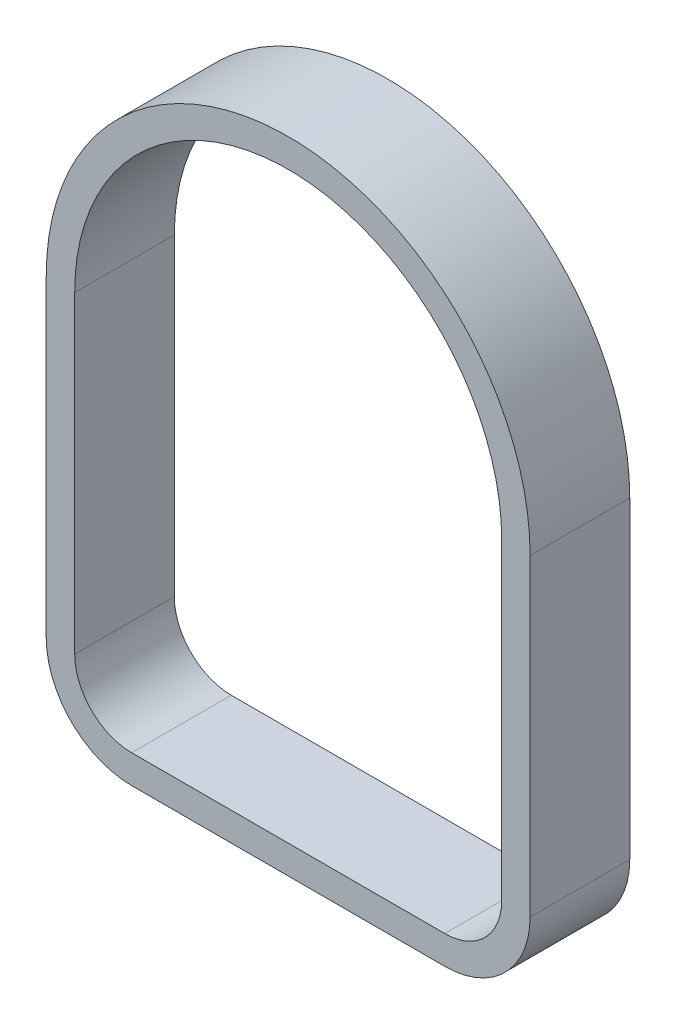
ISO-10303-21;
HEADER;
FILE_DESCRIPTION(('STEP AP214'),'2;1');
FILE_NAME('part.step','',(''),(''),'','','');
FILE_SCHEMA(('AUTOMOTIVE_DESIGN { 1 0 10303 214 1 1 1 1 }'));
ENDSEC;
DATA;
#1=APPLICATION_CONTEXT('core data for automotive mechanical design processes');
#2=APPLICATION_PROTOCOL_DEFINITION('international standard','automotive_design',2000,#1);
#3=PRODUCT_CONTEXT('',#1,'mechanical');
#4=PRODUCT('Part','Part','',(#3));
#5=PRODUCT_RELATED_PRODUCT_CATEGORY('part','',(#4));
#6=PRODUCT_DEFINITION_FORMATION('','',#4);
#7=PRODUCT_DEFINITION_CONTEXT('part definition',#1,'design');
#8=PRODUCT_DEFINITION('design','',#6,#7);
#9=PRODUCT_DEFINITION_SHAPE('','',#8);
#10=(LENGTH_UNIT() NAMED_UNIT(*) SI_UNIT(.MILLI.,.METRE.));
#11=(NAMED_UNIT(*) PLANE_ANGLE_UNIT() SI_UNIT($,.RADIAN.));
#12=(NAMED_UNIT(*) SI_UNIT($,.STERADIAN.) SOLID_ANGLE_UNIT());
#13=UNCERTAINTY_MEASURE_WITH_UNIT(LENGTH_MEASURE(1.E-05),#10,'distance_accuracy_value','');
#14=(GEOMETRIC_REPRESENTATION_CONTEXT(3) GLOBAL_UNCERTAINTY_ASSIGNED_CONTEXT((#13)) GLOBAL_UNIT_ASSIGNED_CONTEXT((#10,
#11,#12)) REPRESENTATION_CONTEXT('',''));
#15=CARTESIAN_POINT('',(0.,0.,0.));
#16=DIRECTION('',(0.,0.,1.));
#17=DIRECTION('',(1.,0.,0.));
#18=AXIS2_PLACEMENT_3D('',#15,#16,#17);
#19=CARTESIAN_POINT('',(-2.,-1.,0.));
#20=DIRECTION('',(0.,0.,1.));
#21=DIRECTION('',(1.,0.,0.));
#22=AXIS2_PLACEMENT_3D('',#19,#20,#21);
#23=CYLINDRICAL_SURFACE('',#22,2.);
#24=CARTESIAN_POINT('',(-2.,-1.,0.));
#25=DIRECTION('',(0.,0.,1.));
#26=DIRECTION('',(1.,0.,0.));
#27=AXIS2_PLACEMENT_3D('',#24,#25,#26);
#28=CIRCLE('',#27,2.);
#29=CARTESIAN_POINT('',(-2.,-3.,0.));
#30=VERTEX_POINT('',#29);
#31=CARTESIAN_POINT('',(0.,-1.,0.));
#32=VERTEX_POINT('',#31);
#33=EDGE_CURVE('E33',#30,#32,#28,.T.);
#34=ORIENTED_EDGE('',*,*,#33,.F.);
#35=DIRECTION('',(0.,0.,1.));
#36=VECTOR('',#35,1.);
#37=CARTESIAN_POINT('',(-2.,-3.,0.));
#38=LINE('',#37,#36);
#39=CARTESIAN_POINT('',(-2.,-3.,3.5));
#40=VERTEX_POINT('',#39);
#41=EDGE_CURVE('E9',#30,#40,#38,.T.);
#42=ORIENTED_EDGE('',*,*,#41,.T.);
#43=CARTESIAN_POINT('',(-2.,-1.,3.5));
#44=DIRECTION('',(0.,0.,-1.));
#45=DIRECTION('',(0.,-1.,0.));
#46=AXIS2_PLACEMENT_3D('',#43,#44,#45);
#47=CIRCLE('',#46,2.);
#48=CARTESIAN_POINT('',(0.,-1.,3.5));
#49=VERTEX_POINT('',#48);
#50=EDGE_CURVE('E123',#49,#40,#47,.T.);
#51=ORIENTED_EDGE('',*,*,#50,.F.);
#52=DIRECTION('',(0.,0.,1.));
#53=VECTOR('',#52,1.);
#54=CARTESIAN_POINT('',(0.,-1.,0.));
#55=LINE('',#54,#53);
#56=EDGE_CURVE('E145',#32,#49,#55,.T.);
#57=ORIENTED_EDGE('',*,*,#56,.F.);
#58=EDGE_LOOP('',(#34,#42,#51,#57));
#59=FACE_BOUND('',#58,.T.);
#60=ADVANCED_FACE('F15',(#59),#23,.F.);
#61=CARTESIAN_POINT('',(-13.,-3.,0.));
#62=DIRECTION('',(0.,-1.,0.));
#63=DIRECTION('',(1.,0.,0.));
#64=AXIS2_PLACEMENT_3D('',#61,#62,#63);
#65=PLANE('',#64);
#66=DIRECTION('',(1.,0.,0.));
#67=VECTOR('',#66,1.);
#68=CARTESIAN_POINT('',(-10.250000027205,-3.,0.));
#69=LINE('',#68,#67);
#70=CARTESIAN_POINT('',(-13.,-3.,0.));
#71=VERTEX_POINT('',#70);
#72=EDGE_CURVE('E168',#71,#30,#69,.T.);
#73=ORIENTED_EDGE('',*,*,#72,.F.);
#74=DIRECTION('',(0.,0.,1.));
#75=VECTOR('',#74,1.);
#76=CARTESIAN_POINT('',(-13.,-3.,0.));
#77=LINE('',#76,#75);
#78=CARTESIAN_POINT('',(-13.,-3.,3.5));
#79=VERTEX_POINT('',#78);
#80=EDGE_CURVE('E25',#71,#79,#77,.T.);
#81=ORIENTED_EDGE('',*,*,#80,.T.);
#82=DIRECTION('',(-1.,0.,0.));
#83=VECTOR('',#82,1.);
#84=CARTESIAN_POINT('',(-10.250000027205,-3.,3.5));
#85=LINE('',#84,#83);
#86=EDGE_CURVE('E182',#40,#79,#85,.T.);
#87=ORIENTED_EDGE('',*,*,#86,.F.);
#88=ORIENTED_EDGE('',*,*,#41,.F.);
#89=EDGE_LOOP('',(#73,#81,#87,#88));
#90=FACE_BOUND('',#89,.T.);
#91=ADVANCED_FACE('F221',(#90),#65,.F.);
#92=CARTESIAN_POINT('',(-13.,-1.,0.));
#93=DIRECTION('',(0.,0.,1.));
#94=DIRECTION('',(1.,0.,0.));
#95=AXIS2_PLACEMENT_3D('',#92,#93,#94);
#96=CYLINDRICAL_SURFACE('',#95,2.);
#97=CARTESIAN_POINT('',(-13.,-1.,0.));
#98=DIRECTION('',(0.,0.,1.));
#99=DIRECTION('',(1.,0.,0.));
#100=AXIS2_PLACEMENT_3D('',#97,#98,#99);
#101=CIRCLE('',#100,2.);
#102=CARTESIAN_POINT('',(-15.,-1.,0.));
#103=VERTEX_POINT('',#102);
#104=EDGE_CURVE('E170',#103,#71,#101,.T.);
#105=ORIENTED_EDGE('',*,*,#104,.F.);
#106=DIRECTION('',(0.,0.,1.));
#107=VECTOR('',#106,1.);
#108=CARTESIAN_POINT('',(-15.,-1.,0.));
#109=LINE('',#108,#107);
#110=CARTESIAN_POINT('',(-15.,-1.,3.5));
#111=VERTEX_POINT('',#110);
#112=EDGE_CURVE('E181',#103,#111,#109,.T.);
#113=ORIENTED_EDGE('',*,*,#112,.T.);
#114=CARTESIAN_POINT('',(-13.,-1.,3.5));
#115=DIRECTION('',(0.,0.,-1.));
#116=DIRECTION('',(0.,-1.,0.));
#117=AXIS2_PLACEMENT_3D('',#114,#115,#116);
#118=CIRCLE('',#117,2.);
#119=EDGE_CURVE('E183',#79,#111,#118,.T.);
#120=ORIENTED_EDGE('',*,*,#119,.F.);
#121=ORIENTED_EDGE('',*,*,#80,.F.);
#122=EDGE_LOOP('',(#105,#113,#120,#121));
#123=FACE_BOUND('',#122,.T.);
#124=ADVANCED_FACE('F218',(#123),#96,.F.);
#125=CARTESIAN_POINT('',(-15.,10.,0.));
#126=DIRECTION('',(-1.,0.,0.));
#127=DIRECTION('',(0.,0.,1.));
#128=AXIS2_PLACEMENT_3D('',#125,#126,#127);
#129=PLANE('',#128);
#130=DIRECTION('',(0.,-1.,0.));
#131=VECTOR('',#130,1.);
#132=CARTESIAN_POINT('',(-15.,7.85445364564918,0.));
#133=LINE('',#132,#131);
#134=CARTESIAN_POINT('',(-15.,10.,0.));
#135=VERTEX_POINT('',#134);
#136=EDGE_CURVE('E174',#135,#103,#133,.T.);
#137=ORIENTED_EDGE('',*,*,#136,.F.);
#138=DIRECTION('',(0.,0.,1.));
#139=VECTOR('',#138,1.);
#140=CARTESIAN_POINT('',(-15.,10.,0.));
#141=LINE('',#140,#139);
#142=CARTESIAN_POINT('',(-15.,10.,3.5));
#143=VERTEX_POINT('',#142);
#144=EDGE_CURVE('E187',#135,#143,#141,.T.);
#145=ORIENTED_EDGE('',*,*,#144,.T.);
#146=DIRECTION('',(0.,1.,0.));
#147=VECTOR('',#146,1.);
#148=CARTESIAN_POINT('',(-15.,7.85445364564918,3.5));
#149=LINE('',#148,#147);
#150=EDGE_CURVE('E135',#111,#143,#149,.T.);
#151=ORIENTED_EDGE('',*,*,#150,.F.);
#152=ORIENTED_EDGE('',*,*,#112,.F.);
#153=EDGE_LOOP('',(#137,#145,#151,#152));
#154=FACE_BOUND('',#153,.T.);
#155=ADVANCED_FACE('F214',(#154),#129,.F.);
#156=CARTESIAN_POINT('',(-7.5,10.,0.));
#157=DIRECTION('',(0.,0.,1.));
#158=DIRECTION('',(1.,0.,0.));
#159=AXIS2_PLACEMENT_3D('',#156,#157,#158);
#160=CYLINDRICAL_SURFACE('',#159,7.5);
#161=CARTESIAN_POINT('',(-7.5,10.,0.));
#162=DIRECTION('',(0.,0.,1.));
#163=DIRECTION('',(1.,0.,0.));
#164=AXIS2_PLACEMENT_3D('',#161,#162,#163);
#165=CIRCLE('',#164,7.5);
#166=CARTESIAN_POINT('',(0.,10.,0.));
#167=VERTEX_POINT('',#166);
#168=EDGE_CURVE('E191',#167,#135,#165,.T.);
#169=ORIENTED_EDGE('',*,*,#168,.F.);
#170=DIRECTION('',(0.,0.,1.));
#171=VECTOR('',#170,1.);
#172=CARTESIAN_POINT('',(0.,10.,0.));
#173=LINE('',#172,#171);
#174=CARTESIAN_POINT('',(0.,10.,3.5));
#175=VERTEX_POINT('',#174);
#176=EDGE_CURVE('E194',#167,#175,#173,.T.);
#177=ORIENTED_EDGE('',*,*,#176,.T.);
#178=CARTESIAN_POINT('',(-7.5,10.,3.5));
#179=DIRECTION('',(0.,0.,-1.));
#180=DIRECTION('',(0.,-1.,0.));
#181=AXIS2_PLACEMENT_3D('',#178,#179,#180);
#182=CIRCLE('',#181,7.5);
#183=EDGE_CURVE('E131',#143,#175,#182,.T.);
#184=ORIENTED_EDGE('',*,*,#183,.F.);
#185=ORIENTED_EDGE('',*,*,#144,.F.);
#186=EDGE_LOOP('',(#169,#177,#184,#185));
#187=FACE_BOUND('',#186,.T.);
#188=ADVANCED_FACE('F211',(#187),#160,.F.);
#189=CARTESIAN_POINT('',(0.,0.,0.));
#190=DIRECTION('',(1.,0.,0.));
#191=DIRECTION('',(0.,1.,0.));
#192=AXIS2_PLACEMENT_3D('',#189,#190,#191);
#193=PLANE('',#192);
#194=DIRECTION('',(0.,1.,0.));
#195=VECTOR('',#194,1.);
#196=CARTESIAN_POINT('',(0.,2.85445364564919,0.));
#197=LINE('',#196,#195);
#198=EDGE_CURVE('E139',#32,#167,#197,.T.);
#199=ORIENTED_EDGE('',*,*,#198,.F.);
#200=ORIENTED_EDGE('',*,*,#56,.T.);
#201=DIRECTION('',(0.,-1.,0.));
#202=VECTOR('',#201,1.);
#203=CARTESIAN_POINT('',(0.,2.85445364564919,3.5));
#204=LINE('',#203,#202);
#205=EDGE_CURVE('E129',#175,#49,#204,.T.);
#206=ORIENTED_EDGE('',*,*,#205,.F.);
#207=ORIENTED_EDGE('',*,*,#176,.F.);
#208=EDGE_LOOP('',(#199,#200,#206,#207));
#209=FACE_BOUND('',#208,.T.);
#210=ADVANCED_FACE('F205',(#209),#193,.F.);
#211=CARTESIAN_POINT('',(-2.,-1.,0.));
#212=DIRECTION('',(0.,0.,1.));
#213=DIRECTION('',(1.,0.,0.));
#214=AXIS2_PLACEMENT_3D('',#211,#212,#213);
#215=CYLINDRICAL_SURFACE('',#214,3.);
#216=CARTESIAN_POINT('',(-2.,-1.,0.));
#217=DIRECTION('',(0.,0.,-1.));
#218=DIRECTION('',(0.,-1.,0.));
#219=AXIS2_PLACEMENT_3D('',#216,#217,#218);
#220=CIRCLE('',#219,3.);
#221=CARTESIAN_POINT('',(1.,-0.999999999999999,0.));
#222=VERTEX_POINT('',#221);
#223=CARTESIAN_POINT('',(-2.,-4.,0.));
#224=VERTEX_POINT('',#223);
#225=EDGE_CURVE('E140',#222,#224,#220,.T.);
#226=ORIENTED_EDGE('',*,*,#225,.F.);
#227=DIRECTION('',(0.,0.,1.));
#228=VECTOR('',#227,1.);
#229=CARTESIAN_POINT('',(1.,-0.999999999999999,0.));
#230=LINE('',#229,#228);
#231=CARTESIAN_POINT('',(1.,-0.999999999999999,3.5));
#232=VERTEX_POINT('',#231);
#233=EDGE_CURVE('E143',#222,#232,#230,.T.);
#234=ORIENTED_EDGE('',*,*,#233,.T.);
#235=CARTESIAN_POINT('',(-2.,-1.,3.5));
#236=DIRECTION('',(0.,0.,1.));
#237=DIRECTION('',(1.,0.,0.));
#238=AXIS2_PLACEMENT_3D('',#235,#236,#237);
#239=CIRCLE('',#238,3.);
#240=CARTESIAN_POINT('',(-2.,-4.,3.5));
#241=VERTEX_POINT('',#240);
#242=EDGE_CURVE('E127',#241,#232,#239,.T.);
#243=ORIENTED_EDGE('',*,*,#242,.F.);
#244=DIRECTION('',(0.,0.,1.));
#245=VECTOR('',#244,1.);
#246=CARTESIAN_POINT('',(-2.,-4.,0.));
#247=LINE('',#246,#245);
#248=EDGE_CURVE('E146',#224,#241,#247,.T.);
#249=ORIENTED_EDGE('',*,*,#248,.F.);
#250=EDGE_LOOP('',(#226,#234,#243,#249));
#251=FACE_BOUND('',#250,.T.);
#252=ADVANCED_FACE('F246',(#251),#215,.T.);
#253=CARTESIAN_POINT('',(-13.,-4.,0.));
#254=DIRECTION('',(0.,-1.,0.));
#255=DIRECTION('',(0.,0.,-1.));
#256=AXIS2_PLACEMENT_3D('',#253,#254,#255);
#257=PLANE('',#256);
#258=DIRECTION('',(-1.,0.,0.));
#259=VECTOR('',#258,1.);
#260=CARTESIAN_POINT('',(-2.,-4.,0.));
#261=LINE('',#260,#259);
#262=CARTESIAN_POINT('',(-13.,-4.,0.));
#263=VERTEX_POINT('',#262);
#264=EDGE_CURVE('E142',#224,#263,#261,.T.);
#265=ORIENTED_EDGE('',*,*,#264,.F.);
#266=ORIENTED_EDGE('',*,*,#248,.T.);
#267=DIRECTION('',(1.,0.,0.));
#268=VECTOR('',#267,1.);
#269=CARTESIAN_POINT('',(-2.,-4.,3.5));
#270=LINE('',#269,#268);
#271=CARTESIAN_POINT('',(-13.,-4.,3.5));
#272=VERTEX_POINT('',#271);
#273=EDGE_CURVE('E148',#272,#241,#270,.T.);
#274=ORIENTED_EDGE('',*,*,#273,.F.);
#275=DIRECTION('',(0.,0.,1.));
#276=VECTOR('',#275,1.);
#277=CARTESIAN_POINT('',(-13.,-4.,0.));
#278=LINE('',#277,#276);
#279=EDGE_CURVE('E151',#263,#272,#278,.T.);
#280=ORIENTED_EDGE('',*,*,#279,.F.);
#281=EDGE_LOOP('',(#265,#266,#274,#280));
#282=FACE_BOUND('',#281,.T.);
#283=ADVANCED_FACE('F244',(#282),#257,.T.);
#284=CARTESIAN_POINT('',(-13.,-1.,0.));
#285=DIRECTION('',(0.,0.,1.));
#286=DIRECTION('',(1.,0.,0.));
#287=AXIS2_PLACEMENT_3D('',#284,#285,#286);
#288=CYLINDRICAL_SURFACE('',#287,3.);
#289=CARTESIAN_POINT('',(-13.,-1.,0.));
#290=DIRECTION('',(0.,0.,-1.));
#291=DIRECTION('',(0.,-1.,0.));
#292=AXIS2_PLACEMENT_3D('',#289,#290,#291);
#293=CIRCLE('',#292,3.);
#294=CARTESIAN_POINT('',(-16.,-1.,0.));
#295=VERTEX_POINT('',#294);
#296=EDGE_CURVE('E153',#263,#295,#293,.T.);
#297=ORIENTED_EDGE('',*,*,#296,.F.);
#298=ORIENTED_EDGE('',*,*,#279,.T.);
#299=CARTESIAN_POINT('',(-13.,-1.,3.5));
#300=DIRECTION('',(0.,0.,1.));
#301=DIRECTION('',(1.,0.,0.));
#302=AXIS2_PLACEMENT_3D('',#299,#300,#301);
#303=CIRCLE('',#302,3.);
#304=CARTESIAN_POINT('',(-16.,-1.,3.5));
#305=VERTEX_POINT('',#304);
#306=EDGE_CURVE('E155',#305,#272,#303,.T.);
#307=ORIENTED_EDGE('',*,*,#306,.F.);
#308=DIRECTION('',(0.,0.,1.));
#309=VECTOR('',#308,1.);
#310=CARTESIAN_POINT('',(-16.,-1.,0.));
#311=LINE('',#310,#309);
#312=EDGE_CURVE('E158',#295,#305,#311,.T.);
#313=ORIENTED_EDGE('',*,*,#312,.F.);
#314=EDGE_LOOP('',(#297,#298,#307,#313));
#315=FACE_BOUND('',#314,.T.);
#316=ADVANCED_FACE('F241',(#315),#288,.T.);
#317=CARTESIAN_POINT('',(-16.,9.99999999999999,0.));
#318=DIRECTION('',(-1.,0.,0.));
#319=DIRECTION('',(0.,0.,1.));
#320=AXIS2_PLACEMENT_3D('',#317,#318,#319);
#321=PLANE('',#320);
#322=DIRECTION('',(0.,1.,0.));
#323=VECTOR('',#322,1.);
#324=CARTESIAN_POINT('',(-16.,-1.,0.));
#325=LINE('',#324,#323);
#326=CARTESIAN_POINT('',(-16.,9.99999999999999,0.));
#327=VERTEX_POINT('',#326);
#328=EDGE_CURVE('E160',#295,#327,#325,.T.);
#329=ORIENTED_EDGE('',*,*,#328,.F.);
#330=ORIENTED_EDGE('',*,*,#312,.T.);
#331=DIRECTION('',(0.,-1.,0.));
#332=VECTOR('',#331,1.);
#333=CARTESIAN_POINT('',(-16.,-1.,3.5));
#334=LINE('',#333,#332);
#335=CARTESIAN_POINT('',(-16.,9.99999999999999,3.5));
#336=VERTEX_POINT('',#335);
#337=EDGE_CURVE('E116',#336,#305,#334,.T.);
#338=ORIENTED_EDGE('',*,*,#337,.F.);
#339=DIRECTION('',(0.,0.,1.));
#340=VECTOR('',#339,1.);
#341=CARTESIAN_POINT('',(-16.,9.99999999999999,0.));
#342=LINE('',#341,#340);
#343=EDGE_CURVE('E112',#327,#336,#342,.T.);
#344=ORIENTED_EDGE('',*,*,#343,.F.);
#345=EDGE_LOOP('',(#329,#330,#338,#344));
#346=FACE_BOUND('',#345,.T.);
#347=ADVANCED_FACE('F243',(#346),#321,.T.);
#348=CARTESIAN_POINT('',(-7.5,10.,0.));
#349=DIRECTION('',(0.,0.,1.));
#350=DIRECTION('',(1.,0.,0.));
#351=AXIS2_PLACEMENT_3D('',#348,#349,#350);
#352=CYLINDRICAL_SURFACE('',#351,8.5);
#353=CARTESIAN_POINT('',(-7.5,10.,0.));
#354=DIRECTION('',(0.,0.,-1.));
#355=DIRECTION('',(0.,-1.,0.));
#356=AXIS2_PLACEMENT_3D('',#353,#354,#355);
#357=CIRCLE('',#356,8.5);
#358=CARTESIAN_POINT('',(0.999999999999992,10.,0.));
#359=VERTEX_POINT('',#358);
#360=EDGE_CURVE('E101',#327,#359,#357,.T.);
#361=ORIENTED_EDGE('',*,*,#360,.F.);
#362=ORIENTED_EDGE('',*,*,#343,.T.);
#363=CARTESIAN_POINT('',(-7.5,10.,3.5));
#364=DIRECTION('',(0.,0.,1.));
#365=DIRECTION('',(1.,0.,0.));
#366=AXIS2_PLACEMENT_3D('',#363,#364,#365);
#367=CIRCLE('',#366,8.5);
#368=CARTESIAN_POINT('',(0.999999999999992,10.,3.5));
#369=VERTEX_POINT('',#368);
#370=EDGE_CURVE('E107',#369,#336,#367,.T.);
#371=ORIENTED_EDGE('',*,*,#370,.F.);
#372=DIRECTION('',(0.,0.,1.));
#373=VECTOR('',#372,1.);
#374=CARTESIAN_POINT('',(0.999999999999992,10.,0.));
#375=LINE('',#374,#373);
#376=EDGE_CURVE('E109',#359,#369,#375,.T.);
#377=ORIENTED_EDGE('',*,*,#376,.F.);
#378=EDGE_LOOP('',(#361,#362,#371,#377));
#379=FACE_BOUND('',#378,.T.);
#380=ADVANCED_FACE('F17',(#379),#352,.T.);
#381=CARTESIAN_POINT('',(1.,0.,0.));
#382=DIRECTION('',(1.,0.,0.));
#383=DIRECTION('',(0.,1.,0.));
#384=AXIS2_PLACEMENT_3D('',#381,#382,#383);
#385=PLANE('',#384);
#386=DIRECTION('',(0.,-1.,0.));
#387=VECTOR('',#386,1.);
#388=CARTESIAN_POINT('',(0.999999999999992,10.,0.));
#389=LINE('',#388,#387);
#390=EDGE_CURVE('E122',#359,#222,#389,.T.);
#391=ORIENTED_EDGE('',*,*,#390,.F.);
#392=ORIENTED_EDGE('',*,*,#376,.T.);
#393=DIRECTION('',(0.,1.,0.));
#394=VECTOR('',#393,1.);
#395=CARTESIAN_POINT('',(1.,0.,3.5));
#396=LINE('',#395,#394);
#397=EDGE_CURVE('E19',#232,#369,#396,.T.);
#398=ORIENTED_EDGE('',*,*,#397,.F.);
#399=ORIENTED_EDGE('',*,*,#233,.F.);
#400=EDGE_LOOP('',(#391,#392,#398,#399));
#401=FACE_BOUND('',#400,.T.);
#402=ADVANCED_FACE('F120',(#401),#385,.T.);
#403=CARTESIAN_POINT('',(-7.50000005440995,5.70890729129837,3.5));
#404=DIRECTION('',(0.,0.,1.));
#405=DIRECTION('',(1.,0.,0.));
#406=AXIS2_PLACEMENT_3D('',#403,#404,#405);
#407=PLANE('',#406);
#408=ORIENTED_EDGE('',*,*,#50,.T.);
#409=ORIENTED_EDGE('',*,*,#86,.T.);
#410=ORIENTED_EDGE('',*,*,#119,.T.);
#411=ORIENTED_EDGE('',*,*,#150,.T.);
#412=ORIENTED_EDGE('',*,*,#183,.T.);
#413=ORIENTED_EDGE('',*,*,#205,.T.);
#414=EDGE_LOOP('',(#408,#409,#410,#411,#412,#413));
#415=FACE_BOUND('',#414,.T.);
#416=ORIENTED_EDGE('',*,*,#397,.T.);
#417=ORIENTED_EDGE('',*,*,#370,.T.);
#418=ORIENTED_EDGE('',*,*,#337,.T.);
#419=ORIENTED_EDGE('',*,*,#306,.T.);
#420=ORIENTED_EDGE('',*,*,#273,.T.);
#421=ORIENTED_EDGE('',*,*,#242,.T.);
#422=EDGE_LOOP('',(#416,#417,#418,#419,#420,#421));
#423=FACE_BOUND('',#422,.T.);
#424=ADVANCED_FACE('F125',(#415,#423),#407,.T.);
#425=CARTESIAN_POINT('',(-7.50000005440995,5.70890729129837,0.));
#426=DIRECTION('',(0.,0.,1.));
#427=DIRECTION('',(1.,0.,0.));
#428=AXIS2_PLACEMENT_3D('',#425,#426,#427);
#429=PLANE('',#428);
#430=ORIENTED_EDGE('',*,*,#33,.T.);
#431=ORIENTED_EDGE('',*,*,#198,.T.);
#432=ORIENTED_EDGE('',*,*,#168,.T.);
#433=ORIENTED_EDGE('',*,*,#136,.T.);
#434=ORIENTED_EDGE('',*,*,#104,.T.);
#435=ORIENTED_EDGE('',*,*,#72,.T.);
#436=EDGE_LOOP('',(#430,#431,#432,#433,#434,#435));
#437=FACE_BOUND('',#436,.T.);
#438=ORIENTED_EDGE('',*,*,#390,.T.);
#439=ORIENTED_EDGE('',*,*,#225,.T.);
#440=ORIENTED_EDGE('',*,*,#264,.T.);
#441=ORIENTED_EDGE('',*,*,#296,.T.);
#442=ORIENTED_EDGE('',*,*,#328,.T.);
#443=ORIENTED_EDGE('',*,*,#360,.T.);
#444=EDGE_LOOP('',(#438,#439,#440,#441,#442,#443));
#445=FACE_BOUND('',#444,.T.);
#446=ADVANCED_FACE('F209',(#437,#445),#429,.F.);
#447=CLOSED_SHELL('',(#60,#91,#124,#155,#188,#210,#252,#283,#316,#347,#380,#402,#424,#446));
#448=MANIFOLD_SOLID_BREP('B1',#447);
#449=ADVANCED_BREP_SHAPE_REPRESENTATION('',(#18,#448),#14);
#450=SHAPE_DEFINITION_REPRESENTATION(#9,#449);
ENDSEC;
END-ISO-10303-21;
